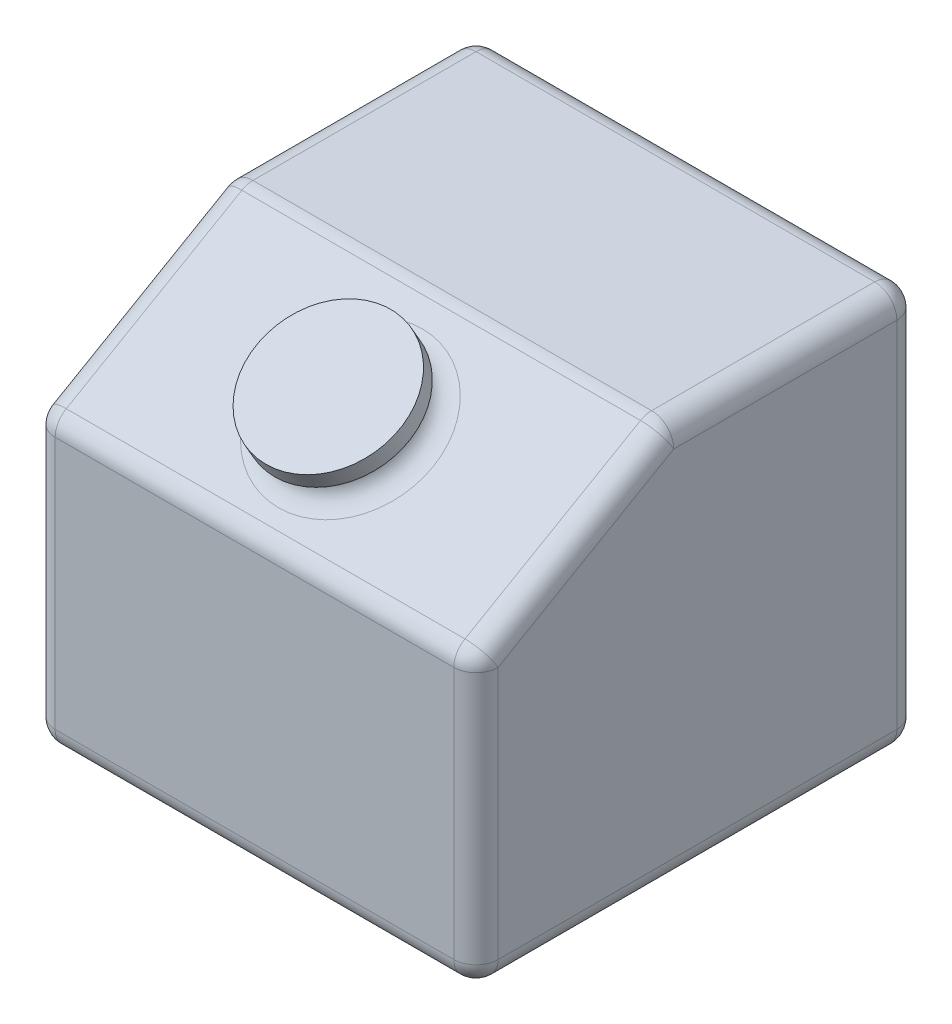
ISO-10303-21;
HEADER;
FILE_DESCRIPTION(('STEP AP214'),'2;1');
FILE_NAME('part.step','',(''),(''),'','','');
FILE_SCHEMA(('AUTOMOTIVE_DESIGN { 1 0 10303 214 1 1 1 1 }'));
ENDSEC;
DATA;
#1=APPLICATION_CONTEXT('core data for automotive mechanical design processes');
#2=APPLICATION_PROTOCOL_DEFINITION('international standard','automotive_design',2000,#1);
#3=PRODUCT_CONTEXT('',#1,'mechanical');
#4=PRODUCT('Part','Part','',(#3));
#5=PRODUCT_RELATED_PRODUCT_CATEGORY('part','',(#4));
#6=PRODUCT_DEFINITION_FORMATION('','',#4);
#7=PRODUCT_DEFINITION_CONTEXT('part definition',#1,'design');
#8=PRODUCT_DEFINITION('design','',#6,#7);
#9=PRODUCT_DEFINITION_SHAPE('','',#8);
#10=(LENGTH_UNIT() NAMED_UNIT(*) SI_UNIT(.MILLI.,.METRE.));
#11=(NAMED_UNIT(*) PLANE_ANGLE_UNIT() SI_UNIT($,.RADIAN.));
#12=(NAMED_UNIT(*) SI_UNIT($,.STERADIAN.) SOLID_ANGLE_UNIT());
#13=UNCERTAINTY_MEASURE_WITH_UNIT(LENGTH_MEASURE(1.E-05),#10,'distance_accuracy_value','');
#14=(GEOMETRIC_REPRESENTATION_CONTEXT(3) GLOBAL_UNCERTAINTY_ASSIGNED_CONTEXT((#13)) GLOBAL_UNIT_ASSIGNED_CONTEXT((#10,
#11,#12)) REPRESENTATION_CONTEXT('',''));
#15=CARTESIAN_POINT('',(0.,0.,0.));
#16=DIRECTION('',(0.,0.,1.));
#17=DIRECTION('',(1.,0.,0.));
#18=AXIS2_PLACEMENT_3D('',#15,#16,#17);
#19=CARTESIAN_POINT('',(100.,172.320508075689,-33.3012701892218));
#20=DIRECTION('',(0.,-0.866025403784438,-0.500000000000001));
#21=DIRECTION('',(0.,0.500000000000001,-0.866025403784438));
#22=AXIS2_PLACEMENT_3D('',#19,#20,#21);
#23=CYLINDRICAL_SURFACE('',#22,27.5);
#24=CARTESIAN_POINT('',(100.,163.660254037844,-38.3012701892219));
#25=DIRECTION('',(0.,-0.866025403784438,-0.500000000000001));
#26=DIRECTION('',(0.,0.500000000000001,-0.866025403784438));
#27=AXIS2_PLACEMENT_3D('',#24,#25,#26);
#28=CIRCLE('',#27,27.5);
#29=CARTESIAN_POINT('',(100.,177.410254037844,-62.1169687932939));
#30=VERTEX_POINT('',#29);
#31=EDGE_CURVE('E231',#30,#30,#28,.F.);
#32=ORIENTED_EDGE('',*,*,#31,.T.);
#33=EDGE_LOOP('',(#32));
#34=FACE_BOUND('',#33,.T.);
#35=CARTESIAN_POINT('',(100.,165.392304845413,-37.3012701892219));
#36=DIRECTION('',(0.,0.866025403784438,0.500000000000001));
#37=DIRECTION('',(0.,-0.500000000000001,0.866025403784438));
#38=AXIS2_PLACEMENT_3D('',#35,#36,#37);
#39=CIRCLE('',#38,27.5);
#40=CARTESIAN_POINT('',(100.,151.642304845413,-13.4855715851498));
#41=VERTEX_POINT('',#40);
#42=EDGE_CURVE('E225',#41,#41,#39,.T.);
#43=ORIENTED_EDGE('',*,*,#42,.F.);
#44=EDGE_LOOP('',(#43));
#45=FACE_BOUND('',#44,.T.);
#46=ADVANCED_FACE('F35',(#34,#45),#23,.T.);
#47=CARTESIAN_POINT('',(0.,180.,0.));
#48=DIRECTION('',(1.,0.,0.));
#49=DIRECTION('',(0.,0.,-1.));
#50=AXIS2_PLACEMENT_3D('',#47,#48,#49);
#51=PLANE('',#50);
#52=DIRECTION('',(0.,-0.500000000000001,0.866025403784438));
#53=VECTOR('',#52,1.);
#54=CARTESIAN_POINT('',(0.,171.339745962156,-91.6025403784437));
#55=LINE('',#54,#53);
#56=CARTESIAN_POINT('',(0.,124.226497308104,-10.));
#57=VERTEX_POINT('',#56);
#58=CARTESIAN_POINT('',(0.,170.,-89.2820323027549));
#59=VERTEX_POINT('',#58);
#60=EDGE_CURVE('E261',#57,#59,#55,.F.);
#61=ORIENTED_EDGE('',*,*,#60,.T.);
#62=DIRECTION('',(0.,0.,1.));
#63=VECTOR('',#62,1.);
#64=CARTESIAN_POINT('',(0.,170.,0.));
#65=LINE('',#64,#63);
#66=CARTESIAN_POINT('',(0.,170.,-190.));
#67=VERTEX_POINT('',#66);
#68=EDGE_CURVE('E263',#59,#67,#65,.F.);
#69=ORIENTED_EDGE('',*,*,#68,.T.);
#70=DIRECTION('',(0.,-1.,0.));
#71=VECTOR('',#70,1.);
#72=CARTESIAN_POINT('',(0.,180.,-190.));
#73=LINE('',#72,#71);
#74=CARTESIAN_POINT('',(0.,10.,-190.));
#75=VERTEX_POINT('',#74);
#76=EDGE_CURVE('E259',#67,#75,#73,.T.);
#77=ORIENTED_EDGE('',*,*,#76,.T.);
#78=DIRECTION('',(0.,0.,1.));
#79=VECTOR('',#78,1.);
#80=CARTESIAN_POINT('',(0.,10.,0.));
#81=LINE('',#80,#79);
#82=CARTESIAN_POINT('',(0.,10.,-10.));
#83=VERTEX_POINT('',#82);
#84=EDGE_CURVE('E255',#75,#83,#81,.T.);
#85=ORIENTED_EDGE('',*,*,#84,.T.);
#86=DIRECTION('',(0.,-1.,0.));
#87=VECTOR('',#86,1.);
#88=CARTESIAN_POINT('',(0.,180.,-10.));
#89=LINE('',#88,#87);
#90=EDGE_CURVE('E257',#83,#57,#89,.F.);
#91=ORIENTED_EDGE('',*,*,#90,.T.);
#92=EDGE_LOOP('',(#61,#69,#77,#85,#91));
#93=FACE_BOUND('',#92,.T.);
#94=ADVANCED_FACE('F413',(#93),#51,.F.);
#95=CARTESIAN_POINT('',(0.,180.,0.));
#96=DIRECTION('',(0.,0.,-1.));
#97=DIRECTION('',(-1.,0.,0.));
#98=AXIS2_PLACEMENT_3D('',#95,#96,#97);
#99=PLANE('',#98);
#100=DIRECTION('',(1.,0.,0.));
#101=VECTOR('',#100,1.);
#102=CARTESIAN_POINT('',(0.,124.226497308104,0.));
#103=LINE('',#102,#101);
#104=CARTESIAN_POINT('',(190.,124.226497308104,0.));
#105=VERTEX_POINT('',#104);
#106=CARTESIAN_POINT('',(10.,124.226497308104,0.));
#107=VERTEX_POINT('',#106);
#108=EDGE_CURVE('E290',#105,#107,#103,.F.);
#109=ORIENTED_EDGE('',*,*,#108,.T.);
#110=DIRECTION('',(0.,-1.,0.));
#111=VECTOR('',#110,1.);
#112=CARTESIAN_POINT('',(10.,180.,0.));
#113=LINE('',#112,#111);
#114=CARTESIAN_POINT('',(10.,10.,0.));
#115=VERTEX_POINT('',#114);
#116=EDGE_CURVE('E292',#107,#115,#113,.T.);
#117=ORIENTED_EDGE('',*,*,#116,.T.);
#118=DIRECTION('',(1.,0.,0.));
#119=VECTOR('',#118,1.);
#120=CARTESIAN_POINT('',(200.,10.,0.));
#121=LINE('',#120,#119);
#122=CARTESIAN_POINT('',(190.,10.,0.));
#123=VERTEX_POINT('',#122);
#124=EDGE_CURVE('E286',#115,#123,#121,.T.);
#125=ORIENTED_EDGE('',*,*,#124,.T.);
#126=DIRECTION('',(0.,-1.,0.));
#127=VECTOR('',#126,1.);
#128=CARTESIAN_POINT('',(190.,180.,0.));
#129=LINE('',#128,#127);
#130=EDGE_CURVE('E288',#123,#105,#129,.F.);
#131=ORIENTED_EDGE('',*,*,#130,.T.);
#132=EDGE_LOOP('',(#109,#117,#125,#131));
#133=FACE_BOUND('',#132,.T.);
#134=ADVANCED_FACE('F392',(#133),#99,.F.);
#135=CARTESIAN_POINT('',(200.,180.,0.));
#136=DIRECTION('',(-1.,0.,0.));
#137=DIRECTION('',(0.,0.,1.));
#138=AXIS2_PLACEMENT_3D('',#135,#136,#137);
#139=PLANE('',#138);
#140=DIRECTION('',(0.,-1.,0.));
#141=VECTOR('',#140,1.);
#142=CARTESIAN_POINT('',(200.,180.,-190.));
#143=LINE('',#142,#141);
#144=CARTESIAN_POINT('',(200.,10.,-190.));
#145=VERTEX_POINT('',#144);
#146=CARTESIAN_POINT('',(200.,170.,-190.));
#147=VERTEX_POINT('',#146);
#148=EDGE_CURVE('E281',#145,#147,#143,.F.);
#149=ORIENTED_EDGE('',*,*,#148,.T.);
#150=DIRECTION('',(0.,0.,-1.));
#151=VECTOR('',#150,1.);
#152=CARTESIAN_POINT('',(200.,170.,0.));
#153=LINE('',#152,#151);
#154=CARTESIAN_POINT('',(200.,170.,-89.282032302755));
#155=VERTEX_POINT('',#154);
#156=EDGE_CURVE('E284',#147,#155,#153,.F.);
#157=ORIENTED_EDGE('',*,*,#156,.T.);
#158=DIRECTION('',(0.,0.500000000000001,-0.866025403784438));
#159=VECTOR('',#158,1.);
#160=CARTESIAN_POINT('',(200.,121.339745962156,-5.));
#161=LINE('',#160,#159);
#162=CARTESIAN_POINT('',(200.,124.226497308104,-10.));
#163=VERTEX_POINT('',#162);
#164=EDGE_CURVE('E279',#155,#163,#161,.F.);
#165=ORIENTED_EDGE('',*,*,#164,.T.);
#166=DIRECTION('',(0.,-1.,0.));
#167=VECTOR('',#166,1.);
#168=CARTESIAN_POINT('',(200.,180.,-10.));
#169=LINE('',#168,#167);
#170=CARTESIAN_POINT('',(200.,10.,-10.));
#171=VERTEX_POINT('',#170);
#172=EDGE_CURVE('E277',#163,#171,#169,.T.);
#173=ORIENTED_EDGE('',*,*,#172,.T.);
#174=DIRECTION('',(0.,0.,-1.));
#175=VECTOR('',#174,1.);
#176=CARTESIAN_POINT('',(200.,10.,-200.));
#177=LINE('',#176,#175);
#178=EDGE_CURVE('E275',#171,#145,#177,.T.);
#179=ORIENTED_EDGE('',*,*,#178,.T.);
#180=EDGE_LOOP('',(#149,#157,#165,#173,#179));
#181=FACE_BOUND('',#180,.T.);
#182=ADVANCED_FACE('F490',(#181),#139,.F.);
#183=CARTESIAN_POINT('',(0.,180.,-200.));
#184=DIRECTION('',(0.,0.,1.));
#185=DIRECTION('',(1.,0.,0.));
#186=AXIS2_PLACEMENT_3D('',#183,#184,#185);
#187=PLANE('',#186);
#188=DIRECTION('',(0.,-1.,0.));
#189=VECTOR('',#188,1.);
#190=CARTESIAN_POINT('',(10.,180.,-200.));
#191=LINE('',#190,#189);
#192=CARTESIAN_POINT('',(10.,10.,-200.));
#193=VERTEX_POINT('',#192);
#194=CARTESIAN_POINT('',(10.,170.,-200.));
#195=VERTEX_POINT('',#194);
#196=EDGE_CURVE('E270',#193,#195,#191,.F.);
#197=ORIENTED_EDGE('',*,*,#196,.T.);
#198=DIRECTION('',(-1.,0.,0.));
#199=VECTOR('',#198,1.);
#200=CARTESIAN_POINT('',(0.,170.,-200.));
#201=LINE('',#200,#199);
#202=CARTESIAN_POINT('',(190.,170.,-200.));
#203=VERTEX_POINT('',#202);
#204=EDGE_CURVE('E272',#195,#203,#201,.F.);
#205=ORIENTED_EDGE('',*,*,#204,.T.);
#206=DIRECTION('',(0.,-1.,0.));
#207=VECTOR('',#206,1.);
#208=CARTESIAN_POINT('',(190.,180.,-200.));
#209=LINE('',#208,#207);
#210=CARTESIAN_POINT('',(190.,10.,-200.));
#211=VERTEX_POINT('',#210);
#212=EDGE_CURVE('E268',#203,#211,#209,.T.);
#213=ORIENTED_EDGE('',*,*,#212,.T.);
#214=DIRECTION('',(-1.,0.,0.));
#215=VECTOR('',#214,1.);
#216=CARTESIAN_POINT('',(0.,10.,-200.));
#217=LINE('',#216,#215);
#218=EDGE_CURVE('E266',#211,#193,#217,.T.);
#219=ORIENTED_EDGE('',*,*,#218,.T.);
#220=EDGE_LOOP('',(#197,#205,#213,#219));
#221=FACE_BOUND('',#220,.T.);
#222=ADVANCED_FACE('F485',(#221),#187,.F.);
#223=CARTESIAN_POINT('',(0.,180.,0.));
#224=DIRECTION('',(0.,-1.,0.));
#225=DIRECTION('',(0.,0.,-1.));
#226=AXIS2_PLACEMENT_3D('',#223,#224,#225);
#227=PLANE('',#226);
#228=DIRECTION('',(0.,0.,1.));
#229=VECTOR('',#228,1.);
#230=CARTESIAN_POINT('',(10.,180.,0.));
#231=LINE('',#230,#229);
#232=CARTESIAN_POINT('',(10.,180.,-190.));
#233=VERTEX_POINT('',#232);
#234=CARTESIAN_POINT('',(10.,180.,-89.282032302755));
#235=VERTEX_POINT('',#234);
#236=EDGE_CURVE('E250',#233,#235,#231,.T.);
#237=ORIENTED_EDGE('',*,*,#236,.T.);
#238=DIRECTION('',(-1.,0.,0.));
#239=VECTOR('',#238,1.);
#240=CARTESIAN_POINT('',(200.,180.,-89.282032302755));
#241=LINE('',#240,#239);
#242=CARTESIAN_POINT('',(190.,180.,-89.282032302755));
#243=VERTEX_POINT('',#242);
#244=EDGE_CURVE('E252',#235,#243,#241,.F.);
#245=ORIENTED_EDGE('',*,*,#244,.T.);
#246=DIRECTION('',(0.,0.,-1.));
#247=VECTOR('',#246,1.);
#248=CARTESIAN_POINT('',(190.,180.,0.));
#249=LINE('',#248,#247);
#250=CARTESIAN_POINT('',(190.,180.,-190.));
#251=VERTEX_POINT('',#250);
#252=EDGE_CURVE('E246',#243,#251,#249,.T.);
#253=ORIENTED_EDGE('',*,*,#252,.T.);
#254=DIRECTION('',(-1.,0.,0.));
#255=VECTOR('',#254,1.);
#256=CARTESIAN_POINT('',(0.,180.,-190.));
#257=LINE('',#256,#255);
#258=EDGE_CURVE('E248',#251,#233,#257,.T.);
#259=ORIENTED_EDGE('',*,*,#258,.T.);
#260=EDGE_LOOP('',(#237,#245,#253,#259));
#261=FACE_BOUND('',#260,.T.);
#262=ADVANCED_FACE('F478',(#261),#227,.F.);
#263=CARTESIAN_POINT('',(0.,0.,0.));
#264=DIRECTION('',(0.,-1.,0.));
#265=DIRECTION('',(0.,0.,-1.));
#266=AXIS2_PLACEMENT_3D('',#263,#264,#265);
#267=PLANE('',#266);
#268=DIRECTION('',(0.,0.,-1.));
#269=VECTOR('',#268,1.);
#270=CARTESIAN_POINT('',(190.,0.,0.));
#271=LINE('',#270,#269);
#272=CARTESIAN_POINT('',(190.,0.,-190.));
#273=VERTEX_POINT('',#272);
#274=CARTESIAN_POINT('',(190.,0.,-10.));
#275=VERTEX_POINT('',#274);
#276=EDGE_CURVE('E44',#273,#275,#271,.F.);
#277=ORIENTED_EDGE('',*,*,#276,.T.);
#278=DIRECTION('',(1.,0.,0.));
#279=VECTOR('',#278,1.);
#280=CARTESIAN_POINT('',(0.,0.,-10.));
#281=LINE('',#280,#279);
#282=CARTESIAN_POINT('',(10.,0.,-10.));
#283=VERTEX_POINT('',#282);
#284=EDGE_CURVE('E11',#275,#283,#281,.F.);
#285=ORIENTED_EDGE('',*,*,#284,.T.);
#286=DIRECTION('',(0.,0.,1.));
#287=VECTOR('',#286,1.);
#288=CARTESIAN_POINT('',(10.,0.,-200.));
#289=LINE('',#288,#287);
#290=CARTESIAN_POINT('',(10.,0.,-190.));
#291=VERTEX_POINT('',#290);
#292=EDGE_CURVE('E295',#283,#291,#289,.F.);
#293=ORIENTED_EDGE('',*,*,#292,.T.);
#294=DIRECTION('',(-1.,0.,0.));
#295=VECTOR('',#294,1.);
#296=CARTESIAN_POINT('',(200.,0.,-190.));
#297=LINE('',#296,#295);
#298=EDGE_CURVE('E55',#291,#273,#297,.F.);
#299=ORIENTED_EDGE('',*,*,#298,.T.);
#300=EDGE_LOOP('',(#277,#285,#293,#299));
#301=FACE_BOUND('',#300,.T.);
#302=ADVANCED_FACE('F515',(#301),#267,.T.);
#303=CARTESIAN_POINT('',(0.,180.,-86.6025403784437));
#304=DIRECTION('',(0.,-0.866025403784438,-0.500000000000001));
#305=DIRECTION('',(1.,0.,0.));
#306=AXIS2_PLACEMENT_3D('',#303,#304,#305);
#307=PLANE('',#306);
#308=CARTESIAN_POINT('',(100.,155.,-43.3012701892219));
#309=DIRECTION('',(0.,-0.866025403784438,-0.500000000000001));
#310=DIRECTION('',(0.,0.500000000000001,-0.866025403784438));
#311=AXIS2_PLACEMENT_3D('',#308,#309,#310);
#312=CIRCLE('',#311,37.5);
#313=CARTESIAN_POINT('',(100.,173.75,-75.7772228311383));
#314=VERTEX_POINT('',#313);
#315=EDGE_CURVE('E243',#314,#314,#312,.T.);
#316=ORIENTED_EDGE('',*,*,#315,.T.);
#317=EDGE_LOOP('',(#316));
#318=FACE_BOUND('',#317,.T.);
#319=DIRECTION('',(0.,-0.500000000000001,0.866025403784438));
#320=VECTOR('',#319,1.);
#321=CARTESIAN_POINT('',(190.,180.,-86.6025403784437));
#322=LINE('',#321,#320);
#323=CARTESIAN_POINT('',(190.,132.886751345948,-4.99999999999998));
#324=VERTEX_POINT('',#323);
#325=CARTESIAN_POINT('',(190.,178.660254037844,-84.2820323027549));
#326=VERTEX_POINT('',#325);
#327=EDGE_CURVE('E236',#324,#326,#322,.F.);
#328=ORIENTED_EDGE('',*,*,#327,.T.);
#329=DIRECTION('',(1.,0.,0.));
#330=VECTOR('',#329,1.);
#331=CARTESIAN_POINT('',(0.,178.660254037844,-84.2820323027549));
#332=LINE('',#331,#330);
#333=CARTESIAN_POINT('',(10.,178.660254037844,-84.2820323027549));
#334=VERTEX_POINT('',#333);
#335=EDGE_CURVE('E240',#326,#334,#332,.F.);
#336=ORIENTED_EDGE('',*,*,#335,.T.);
#337=DIRECTION('',(0.,0.500000000000001,-0.866025403784438));
#338=VECTOR('',#337,1.);
#339=CARTESIAN_POINT('',(10.,130.,0.));
#340=LINE('',#339,#338);
#341=CARTESIAN_POINT('',(10.,132.886751345948,-4.99999999999998));
#342=VERTEX_POINT('',#341);
#343=EDGE_CURVE('E238',#334,#342,#340,.F.);
#344=ORIENTED_EDGE('',*,*,#343,.T.);
#345=DIRECTION('',(-1.,0.,0.));
#346=VECTOR('',#345,1.);
#347=CARTESIAN_POINT('',(200.,132.886751345948,-4.99999999999998));
#348=LINE('',#347,#346);
#349=EDGE_CURVE('E234',#342,#324,#348,.F.);
#350=ORIENTED_EDGE('',*,*,#349,.T.);
#351=EDGE_LOOP('',(#328,#336,#344,#350));
#352=FACE_BOUND('',#351,.T.);
#353=ADVANCED_FACE('F464',(#318,#352),#307,.F.);
#354=CARTESIAN_POINT('',(100.,165.392304845413,-37.3012701892218));
#355=DIRECTION('',(0.,0.866025403784438,0.500000000000001));
#356=DIRECTION('',(0.,-0.500000000000001,0.866025403784438));
#357=AXIS2_PLACEMENT_3D('',#354,#355,#356);
#358=CYLINDRICAL_SURFACE('',#357,32.5);
#359=CARTESIAN_POINT('',(100.,165.392304845413,-37.3012701892218));
#360=DIRECTION('',(0.,0.866025403784438,0.500000000000001));
#361=DIRECTION('',(0.,-0.500000000000001,0.866025403784438));
#362=AXIS2_PLACEMENT_3D('',#359,#360,#361);
#363=CIRCLE('',#362,32.5);
#364=CARTESIAN_POINT('',(100.,149.142304845413,-9.15544456622762));
#365=VERTEX_POINT('',#364);
#366=EDGE_CURVE('E222',#365,#365,#363,.T.);
#367=ORIENTED_EDGE('',*,*,#366,.T.);
#368=EDGE_LOOP('',(#367));
#369=FACE_BOUND('',#368,.T.);
#370=CARTESIAN_POINT('',(100.,172.320508075689,-33.3012701892218));
#371=DIRECTION('',(0.,0.866025403784438,0.500000000000001));
#372=DIRECTION('',(0.,-0.500000000000001,0.866025403784438));
#373=AXIS2_PLACEMENT_3D('',#370,#371,#372);
#374=CIRCLE('',#373,32.5);
#375=CARTESIAN_POINT('',(100.,156.070508075689,-5.15544456622761));
#376=VERTEX_POINT('',#375);
#377=EDGE_CURVE('E226',#376,#376,#374,.T.);
#378=ORIENTED_EDGE('',*,*,#377,.F.);
#379=EDGE_LOOP('',(#378));
#380=FACE_BOUND('',#379,.T.);
#381=ADVANCED_FACE('F526',(#369,#380),#358,.T.);
#382=CARTESIAN_POINT('',(100.,165.392304845413,-37.3012701892218));
#383=DIRECTION('',(0.,0.866025403784438,0.500000000000001));
#384=DIRECTION('',(0.,-0.500000000000001,0.866025403784438));
#385=AXIS2_PLACEMENT_3D('',#382,#383,#384);
#386=PLANE('',#385);
#387=ORIENTED_EDGE('',*,*,#42,.T.);
#388=EDGE_LOOP('',(#387));
#389=FACE_BOUND('',#388,.T.);
#390=ORIENTED_EDGE('',*,*,#366,.F.);
#391=EDGE_LOOP('',(#390));
#392=FACE_BOUND('',#391,.T.);
#393=ADVANCED_FACE('F785',(#389,#392),#386,.F.);
#394=CARTESIAN_POINT('',(0.,114.820508075689,66.2916512459886));
#395=DIRECTION('',(0.,0.866025403784438,0.500000000000001));
#396=DIRECTION('',(0.,-0.500000000000002,0.866025403784438));
#397=AXIS2_PLACEMENT_3D('',#394,#395,#396);
#398=PLANE('',#397);
#399=ORIENTED_EDGE('',*,*,#377,.T.);
#400=EDGE_LOOP('',(#399));
#401=FACE_BOUND('',#400,.T.);
#402=ADVANCED_FACE('F511',(#401),#398,.T.);
#403=CARTESIAN_POINT('',(100.,163.660254037844,-38.3012701892219));
#404=DIRECTION('',(0.,-0.866025403784438,-0.500000000000001));
#405=DIRECTION('',(0.,0.500000000000001,-0.866025403784438));
#406=AXIS2_PLACEMENT_3D('',#403,#404,#405);
#407=TOROIDAL_SURFACE('',#406,37.5,10.);
#408=ORIENTED_EDGE('',*,*,#315,.F.);
#409=EDGE_LOOP('',(#408));
#410=FACE_BOUND('',#409,.T.);
#411=ORIENTED_EDGE('',*,*,#31,.F.);
#412=EDGE_LOOP('',(#411));
#413=FACE_BOUND('',#412,.T.);
#414=ADVANCED_FACE('F528',(#410,#413),#407,.F.);
#415=CARTESIAN_POINT('',(10.,10.,0.));
#416=DIRECTION('',(0.,0.,-1.));
#417=DIRECTION('',(-1.,0.,0.));
#418=AXIS2_PLACEMENT_3D('',#415,#416,#417);
#419=CYLINDRICAL_SURFACE('',#418,10.);
#420=CARTESIAN_POINT('',(10.,10.,-190.));
#421=DIRECTION('',(0.,0.,-1.));
#422=DIRECTION('',(-1.,0.,0.));
#423=AXIS2_PLACEMENT_3D('',#420,#421,#422);
#424=CIRCLE('',#423,10.);
#425=EDGE_CURVE('E374',#291,#75,#424,.T.);
#426=ORIENTED_EDGE('',*,*,#425,.F.);
#427=ORIENTED_EDGE('',*,*,#292,.F.);
#428=CARTESIAN_POINT('',(10.,10.,-10.));
#429=DIRECTION('',(0.,0.,1.));
#430=DIRECTION('',(1.,0.,0.));
#431=AXIS2_PLACEMENT_3D('',#428,#429,#430);
#432=CIRCLE('',#431,10.);
#433=EDGE_CURVE('E376',#83,#283,#432,.T.);
#434=ORIENTED_EDGE('',*,*,#433,.F.);
#435=ORIENTED_EDGE('',*,*,#84,.F.);
#436=EDGE_LOOP('',(#426,#427,#434,#435));
#437=FACE_BOUND('',#436,.T.);
#438=ADVANCED_FACE('F37',(#437),#419,.T.);
#439=CARTESIAN_POINT('',(0.,10.,-190.));
#440=DIRECTION('',(1.,0.,0.));
#441=DIRECTION('',(0.,0.,-1.));
#442=AXIS2_PLACEMENT_3D('',#439,#440,#441);
#443=CYLINDRICAL_SURFACE('',#442,10.);
#444=CARTESIAN_POINT('',(190.,10.,-190.));
#445=DIRECTION('',(1.,0.,0.));
#446=DIRECTION('',(0.,0.,-1.));
#447=AXIS2_PLACEMENT_3D('',#444,#445,#446);
#448=CIRCLE('',#447,10.);
#449=EDGE_CURVE('E368',#273,#211,#448,.T.);
#450=ORIENTED_EDGE('',*,*,#449,.F.);
#451=ORIENTED_EDGE('',*,*,#298,.F.);
#452=CARTESIAN_POINT('',(10.,10.,-190.));
#453=DIRECTION('',(-1.,0.,0.));
#454=DIRECTION('',(0.,0.,1.));
#455=AXIS2_PLACEMENT_3D('',#452,#453,#454);
#456=CIRCLE('',#455,10.);
#457=EDGE_CURVE('E371',#193,#291,#456,.T.);
#458=ORIENTED_EDGE('',*,*,#457,.F.);
#459=ORIENTED_EDGE('',*,*,#218,.F.);
#460=EDGE_LOOP('',(#450,#451,#458,#459));
#461=FACE_BOUND('',#460,.T.);
#462=ADVANCED_FACE('F438',(#461),#443,.T.);
#463=CARTESIAN_POINT('',(190.,10.,0.));
#464=DIRECTION('',(0.,0.,1.));
#465=DIRECTION('',(1.,0.,0.));
#466=AXIS2_PLACEMENT_3D('',#463,#464,#465);
#467=CYLINDRICAL_SURFACE('',#466,10.);
#468=CARTESIAN_POINT('',(190.,10.,-10.));
#469=DIRECTION('',(0.,0.,1.));
#470=DIRECTION('',(1.,0.,0.));
#471=AXIS2_PLACEMENT_3D('',#468,#469,#470);
#472=CIRCLE('',#471,10.);
#473=EDGE_CURVE('E362',#275,#171,#472,.T.);
#474=ORIENTED_EDGE('',*,*,#473,.F.);
#475=ORIENTED_EDGE('',*,*,#276,.F.);
#476=CARTESIAN_POINT('',(190.,10.,-190.));
#477=DIRECTION('',(0.,0.,-1.));
#478=DIRECTION('',(-1.,0.,0.));
#479=AXIS2_PLACEMENT_3D('',#476,#477,#478);
#480=CIRCLE('',#479,10.);
#481=EDGE_CURVE('E365',#145,#273,#480,.T.);
#482=ORIENTED_EDGE('',*,*,#481,.F.);
#483=ORIENTED_EDGE('',*,*,#178,.F.);
#484=EDGE_LOOP('',(#474,#475,#482,#483));
#485=FACE_BOUND('',#484,.T.);
#486=ADVANCED_FACE('F447',(#485),#467,.T.);
#487=CARTESIAN_POINT('',(0.,10.,-10.));
#488=DIRECTION('',(-1.,0.,0.));
#489=DIRECTION('',(0.,0.,1.));
#490=AXIS2_PLACEMENT_3D('',#487,#488,#489);
#491=CYLINDRICAL_SURFACE('',#490,10.);
#492=CARTESIAN_POINT('',(10.,10.,-10.));
#493=DIRECTION('',(-1.,0.,0.));
#494=DIRECTION('',(0.,0.,1.));
#495=AXIS2_PLACEMENT_3D('',#492,#493,#494);
#496=CIRCLE('',#495,10.);
#497=EDGE_CURVE('E39',#283,#115,#496,.T.);
#498=ORIENTED_EDGE('',*,*,#497,.F.);
#499=ORIENTED_EDGE('',*,*,#284,.F.);
#500=CARTESIAN_POINT('',(190.,10.,-10.));
#501=DIRECTION('',(1.,0.,0.));
#502=DIRECTION('',(0.,0.,-1.));
#503=AXIS2_PLACEMENT_3D('',#500,#501,#502);
#504=CIRCLE('',#503,10.);
#505=EDGE_CURVE('E359',#123,#275,#504,.T.);
#506=ORIENTED_EDGE('',*,*,#505,.F.);
#507=ORIENTED_EDGE('',*,*,#124,.F.);
#508=EDGE_LOOP('',(#498,#499,#506,#507));
#509=FACE_BOUND('',#508,.T.);
#510=ADVANCED_FACE('F388',(#509),#491,.T.);
#511=CARTESIAN_POINT('',(10.,10.,-10.));
#512=DIRECTION('',(0.,0.,1.));
#513=DIRECTION('',(1.,0.,0.));
#514=AXIS2_PLACEMENT_3D('',#511,#512,#513);
#515=SPHERICAL_SURFACE('',#514,10.);
#516=ORIENTED_EDGE('',*,*,#433,.T.);
#517=ORIENTED_EDGE('',*,*,#497,.T.);
#518=CARTESIAN_POINT('',(10.,10.,-10.));
#519=DIRECTION('',(0.,-1.,0.));
#520=DIRECTION('',(0.,0.,-1.));
#521=AXIS2_PLACEMENT_3D('',#518,#519,#520);
#522=CIRCLE('',#521,10.);
#523=EDGE_CURVE('E357',#83,#115,#522,.F.);
#524=ORIENTED_EDGE('',*,*,#523,.F.);
#525=EDGE_LOOP('',(#516,#517,#524));
#526=FACE_BOUND('',#525,.T.);
#527=ADVANCED_FACE('F383',(#526),#515,.T.);
#528=CARTESIAN_POINT('',(10.,10.,-190.));
#529=DIRECTION('',(0.,0.,1.));
#530=DIRECTION('',(1.,0.,0.));
#531=AXIS2_PLACEMENT_3D('',#528,#529,#530);
#532=SPHERICAL_SURFACE('',#531,10.);
#533=ORIENTED_EDGE('',*,*,#457,.T.);
#534=ORIENTED_EDGE('',*,*,#425,.T.);
#535=CARTESIAN_POINT('',(10.,10.,-190.));
#536=DIRECTION('',(0.,-1.,0.));
#537=DIRECTION('',(0.,0.,-1.));
#538=AXIS2_PLACEMENT_3D('',#535,#536,#537);
#539=CIRCLE('',#538,10.);
#540=EDGE_CURVE('E354',#193,#75,#539,.F.);
#541=ORIENTED_EDGE('',*,*,#540,.F.);
#542=EDGE_LOOP('',(#533,#534,#541));
#543=FACE_BOUND('',#542,.T.);
#544=ADVANCED_FACE('F433',(#543),#532,.T.);
#545=CARTESIAN_POINT('',(190.,10.,-190.));
#546=DIRECTION('',(0.,0.,1.));
#547=DIRECTION('',(1.,0.,0.));
#548=AXIS2_PLACEMENT_3D('',#545,#546,#547);
#549=SPHERICAL_SURFACE('',#548,10.);
#550=ORIENTED_EDGE('',*,*,#481,.T.);
#551=ORIENTED_EDGE('',*,*,#449,.T.);
#552=CARTESIAN_POINT('',(190.,10.,-190.));
#553=DIRECTION('',(0.,-1.,0.));
#554=DIRECTION('',(0.,0.,-1.));
#555=AXIS2_PLACEMENT_3D('',#552,#553,#554);
#556=CIRCLE('',#555,10.);
#557=EDGE_CURVE('E351',#145,#211,#556,.F.);
#558=ORIENTED_EDGE('',*,*,#557,.F.);
#559=EDGE_LOOP('',(#550,#551,#558));
#560=FACE_BOUND('',#559,.T.);
#561=ADVANCED_FACE('F442',(#560),#549,.T.);
#562=CARTESIAN_POINT('',(190.,10.,-10.));
#563=DIRECTION('',(0.,0.,1.));
#564=DIRECTION('',(1.,0.,0.));
#565=AXIS2_PLACEMENT_3D('',#562,#563,#564);
#566=SPHERICAL_SURFACE('',#565,10.);
#567=ORIENTED_EDGE('',*,*,#505,.T.);
#568=ORIENTED_EDGE('',*,*,#473,.T.);
#569=CARTESIAN_POINT('',(190.,10.,-10.));
#570=DIRECTION('',(0.,-1.,0.));
#571=DIRECTION('',(0.,0.,-1.));
#572=AXIS2_PLACEMENT_3D('',#569,#570,#571);
#573=CIRCLE('',#572,10.);
#574=EDGE_CURVE('E348',#123,#171,#573,.F.);
#575=ORIENTED_EDGE('',*,*,#574,.F.);
#576=EDGE_LOOP('',(#567,#568,#575));
#577=FACE_BOUND('',#576,.T.);
#578=ADVANCED_FACE('F449',(#577),#566,.T.);
#579=CARTESIAN_POINT('',(10.,180.,-10.));
#580=DIRECTION('',(0.,-1.,0.));
#581=DIRECTION('',(0.,0.,-1.));
#582=AXIS2_PLACEMENT_3D('',#579,#580,#581);
#583=CYLINDRICAL_SURFACE('',#582,10.);
#584=ORIENTED_EDGE('',*,*,#523,.T.);
#585=ORIENTED_EDGE('',*,*,#116,.F.);
#586=CARTESIAN_POINT('',(10.,124.226497308104,-10.));
#587=DIRECTION('',(0.,1.,0.));
#588=DIRECTION('',(0.,0.,1.));
#589=AXIS2_PLACEMENT_3D('',#586,#587,#588);
#590=CIRCLE('',#589,10.);
#591=EDGE_CURVE('E342',#57,#107,#590,.T.);
#592=ORIENTED_EDGE('',*,*,#591,.F.);
#593=ORIENTED_EDGE('',*,*,#90,.F.);
#594=EDGE_LOOP('',(#584,#585,#592,#593));
#595=FACE_BOUND('',#594,.T.);
#596=ADVANCED_FACE('F397',(#595),#583,.T.);
#597=CARTESIAN_POINT('',(10.,180.,-190.));
#598=DIRECTION('',(0.,-1.,0.));
#599=DIRECTION('',(0.,0.,-1.));
#600=AXIS2_PLACEMENT_3D('',#597,#598,#599);
#601=CYLINDRICAL_SURFACE('',#600,10.);
#602=ORIENTED_EDGE('',*,*,#540,.T.);
#603=ORIENTED_EDGE('',*,*,#76,.F.);
#604=CARTESIAN_POINT('',(10.,170.,-190.));
#605=DIRECTION('',(0.,1.,0.));
#606=DIRECTION('',(0.,0.,1.));
#607=AXIS2_PLACEMENT_3D('',#604,#605,#606);
#608=CIRCLE('',#607,10.);
#609=EDGE_CURVE('E339',#195,#67,#608,.T.);
#610=ORIENTED_EDGE('',*,*,#609,.F.);
#611=ORIENTED_EDGE('',*,*,#196,.F.);
#612=EDGE_LOOP('',(#602,#603,#610,#611));
#613=FACE_BOUND('',#612,.T.);
#614=ADVANCED_FACE('F427',(#613),#601,.T.);
#615=CARTESIAN_POINT('',(0.,170.,-190.));
#616=DIRECTION('',(-1.,0.,0.));
#617=DIRECTION('',(0.,0.,1.));
#618=AXIS2_PLACEMENT_3D('',#615,#616,#617);
#619=CYLINDRICAL_SURFACE('',#618,10.);
#620=CARTESIAN_POINT('',(190.,170.,-190.));
#621=DIRECTION('',(1.,0.,0.));
#622=DIRECTION('',(0.,0.,-1.));
#623=AXIS2_PLACEMENT_3D('',#620,#621,#622);
#624=CIRCLE('',#623,10.);
#625=EDGE_CURVE('E333',#203,#251,#624,.T.);
#626=ORIENTED_EDGE('',*,*,#625,.F.);
#627=ORIENTED_EDGE('',*,*,#204,.F.);
#628=CARTESIAN_POINT('',(10.,170.,-190.));
#629=DIRECTION('',(-1.,0.,0.));
#630=DIRECTION('',(0.,0.,1.));
#631=AXIS2_PLACEMENT_3D('',#628,#629,#630);
#632=CIRCLE('',#631,10.);
#633=EDGE_CURVE('E336',#233,#195,#632,.T.);
#634=ORIENTED_EDGE('',*,*,#633,.F.);
#635=ORIENTED_EDGE('',*,*,#258,.F.);
#636=EDGE_LOOP('',(#626,#627,#634,#635));
#637=FACE_BOUND('',#636,.T.);
#638=ADVANCED_FACE('F482',(#637),#619,.T.);
#639=CARTESIAN_POINT('',(190.,180.,-190.));
#640=DIRECTION('',(0.,-1.,0.));
#641=DIRECTION('',(0.,0.,-1.));
#642=AXIS2_PLACEMENT_3D('',#639,#640,#641);
#643=CYLINDRICAL_SURFACE('',#642,10.);
#644=ORIENTED_EDGE('',*,*,#557,.T.);
#645=ORIENTED_EDGE('',*,*,#212,.F.);
#646=CARTESIAN_POINT('',(190.,170.,-190.));
#647=DIRECTION('',(0.,1.,0.));
#648=DIRECTION('',(0.,0.,1.));
#649=AXIS2_PLACEMENT_3D('',#646,#647,#648);
#650=CIRCLE('',#649,10.);
#651=EDGE_CURVE('E331',#147,#203,#650,.T.);
#652=ORIENTED_EDGE('',*,*,#651,.F.);
#653=ORIENTED_EDGE('',*,*,#148,.F.);
#654=EDGE_LOOP('',(#644,#645,#652,#653));
#655=FACE_BOUND('',#654,.T.);
#656=ADVANCED_FACE('F488',(#655),#643,.T.);
#657=CARTESIAN_POINT('',(190.,180.,-10.));
#658=DIRECTION('',(0.,-1.,0.));
#659=DIRECTION('',(0.,0.,-1.));
#660=AXIS2_PLACEMENT_3D('',#657,#658,#659);
#661=CYLINDRICAL_SURFACE('',#660,10.);
#662=ORIENTED_EDGE('',*,*,#574,.T.);
#663=ORIENTED_EDGE('',*,*,#172,.F.);
#664=CARTESIAN_POINT('',(190.,124.226497308104,-10.));
#665=DIRECTION('',(0.,1.,0.));
#666=DIRECTION('',(-1.,0.,0.));
#667=AXIS2_PLACEMENT_3D('',#664,#665,#666);
#668=CIRCLE('',#667,10.);
#669=EDGE_CURVE('E328',#105,#163,#668,.T.);
#670=ORIENTED_EDGE('',*,*,#669,.F.);
#671=ORIENTED_EDGE('',*,*,#130,.F.);
#672=EDGE_LOOP('',(#662,#663,#670,#671));
#673=FACE_BOUND('',#672,.T.);
#674=ADVANCED_FACE('F453',(#673),#661,.T.);
#675=CARTESIAN_POINT('',(0.,124.226497308104,-10.));
#676=DIRECTION('',(-1.,0.,0.));
#677=DIRECTION('',(0.,0.,1.));
#678=AXIS2_PLACEMENT_3D('',#675,#676,#677);
#679=CYLINDRICAL_SURFACE('',#678,10.);
#680=CARTESIAN_POINT('',(10.,124.226497308104,-10.));
#681=DIRECTION('',(-1.,0.,0.));
#682=DIRECTION('',(0.,-1.,0.));
#683=AXIS2_PLACEMENT_3D('',#680,#681,#682);
#684=CIRCLE('',#683,10.);
#685=EDGE_CURVE('E345',#107,#342,#684,.T.);
#686=ORIENTED_EDGE('',*,*,#685,.F.);
#687=ORIENTED_EDGE('',*,*,#108,.F.);
#688=CARTESIAN_POINT('',(190.,124.226497308104,-9.99999999999999));
#689=DIRECTION('',(1.,0.,0.));
#690=DIRECTION('',(0.,0.,-1.));
#691=AXIS2_PLACEMENT_3D('',#688,#689,#690);
#692=CIRCLE('',#691,10.);
#693=EDGE_CURVE('E325',#324,#105,#692,.T.);
#694=ORIENTED_EDGE('',*,*,#693,.F.);
#695=ORIENTED_EDGE('',*,*,#349,.F.);
#696=EDGE_LOOP('',(#686,#687,#694,#695));
#697=FACE_BOUND('',#696,.T.);
#698=ADVANCED_FACE('F401',(#697),#679,.T.);
#699=CARTESIAN_POINT('',(10.,124.226497308104,-10.));
#700=DIRECTION('',(0.,0.,1.));
#701=DIRECTION('',(1.,0.,0.));
#702=AXIS2_PLACEMENT_3D('',#699,#700,#701);
#703=SPHERICAL_SURFACE('',#702,10.);
#704=ORIENTED_EDGE('',*,*,#591,.T.);
#705=ORIENTED_EDGE('',*,*,#685,.T.);
#706=CARTESIAN_POINT('',(10.,124.226497308104,-9.99999999999999));
#707=DIRECTION('',(0.,-0.500000000000002,0.866025403784438));
#708=DIRECTION('',(0.,-0.866025403784438,-0.500000000000002));
#709=AXIS2_PLACEMENT_3D('',#706,#707,#708);
#710=CIRCLE('',#709,10.);
#711=EDGE_CURVE('E322',#57,#342,#710,.F.);
#712=ORIENTED_EDGE('',*,*,#711,.F.);
#713=EDGE_LOOP('',(#704,#705,#712));
#714=FACE_BOUND('',#713,.T.);
#715=ADVANCED_FACE('F405',(#714),#703,.T.);
#716=CARTESIAN_POINT('',(10.,170.,-190.));
#717=DIRECTION('',(0.,0.,1.));
#718=DIRECTION('',(1.,0.,0.));
#719=AXIS2_PLACEMENT_3D('',#716,#717,#718);
#720=SPHERICAL_SURFACE('',#719,10.);
#721=ORIENTED_EDGE('',*,*,#633,.T.);
#722=ORIENTED_EDGE('',*,*,#609,.T.);
#723=CARTESIAN_POINT('',(10.,170.,-190.));
#724=DIRECTION('',(0.,0.,-1.));
#725=DIRECTION('',(-1.,0.,0.));
#726=AXIS2_PLACEMENT_3D('',#723,#724,#725);
#727=CIRCLE('',#726,10.);
#728=EDGE_CURVE('E320',#233,#67,#727,.F.);
#729=ORIENTED_EDGE('',*,*,#728,.F.);
#730=EDGE_LOOP('',(#721,#722,#729));
#731=FACE_BOUND('',#730,.T.);
#732=ADVANCED_FACE('F423',(#731),#720,.T.);
#733=CARTESIAN_POINT('',(190.,170.,-190.));
#734=DIRECTION('',(0.,0.,1.));
#735=DIRECTION('',(1.,0.,0.));
#736=AXIS2_PLACEMENT_3D('',#733,#734,#735);
#737=SPHERICAL_SURFACE('',#736,10.);
#738=ORIENTED_EDGE('',*,*,#651,.T.);
#739=ORIENTED_EDGE('',*,*,#625,.T.);
#740=CARTESIAN_POINT('',(190.,170.,-190.));
#741=DIRECTION('',(0.,0.,-1.));
#742=DIRECTION('',(-1.,0.,0.));
#743=AXIS2_PLACEMENT_3D('',#740,#741,#742);
#744=CIRCLE('',#743,10.);
#745=EDGE_CURVE('E317',#147,#251,#744,.F.);
#746=ORIENTED_EDGE('',*,*,#745,.F.);
#747=EDGE_LOOP('',(#738,#739,#746));
#748=FACE_BOUND('',#747,.T.);
#749=ADVANCED_FACE('F492',(#748),#737,.T.);
#750=CARTESIAN_POINT('',(190.,124.226497308104,-10.));
#751=DIRECTION('',(0.,0.,1.));
#752=DIRECTION('',(1.,0.,0.));
#753=AXIS2_PLACEMENT_3D('',#750,#751,#752);
#754=SPHERICAL_SURFACE('',#753,10.);
#755=ORIENTED_EDGE('',*,*,#693,.T.);
#756=ORIENTED_EDGE('',*,*,#669,.T.);
#757=CARTESIAN_POINT('',(190.,124.226497308104,-10.));
#758=DIRECTION('',(0.,-0.500000000000002,0.866025403784437));
#759=DIRECTION('',(0.,-0.866025403784437,-0.500000000000002));
#760=AXIS2_PLACEMENT_3D('',#757,#758,#759);
#761=CIRCLE('',#760,10.);
#762=EDGE_CURVE('E314',#324,#163,#761,.F.);
#763=ORIENTED_EDGE('',*,*,#762,.F.);
#764=EDGE_LOOP('',(#755,#756,#763));
#765=FACE_BOUND('',#764,.T.);
#766=ADVANCED_FACE('F456',(#765),#754,.T.);
#767=CARTESIAN_POINT('',(10.,133.839745962156,-26.6506350946111));
#768=DIRECTION('',(0.,0.500000000000001,-0.866025403784438));
#769=DIRECTION('',(0.,0.866025403784438,0.500000000000001));
#770=AXIS2_PLACEMENT_3D('',#767,#768,#769);
#771=CYLINDRICAL_SURFACE('',#770,10.);
#772=ORIENTED_EDGE('',*,*,#711,.T.);
#773=ORIENTED_EDGE('',*,*,#343,.F.);
#774=CARTESIAN_POINT('',(10.,170.,-89.2820323027549));
#775=DIRECTION('',(0.,0.500000000000001,-0.866025403784438));
#776=DIRECTION('',(0.,0.866025403784438,0.500000000000001));
#777=AXIS2_PLACEMENT_3D('',#774,#775,#776);
#778=CIRCLE('',#777,10.);
#779=EDGE_CURVE('E311',#59,#334,#778,.T.);
#780=ORIENTED_EDGE('',*,*,#779,.F.);
#781=ORIENTED_EDGE('',*,*,#60,.F.);
#782=EDGE_LOOP('',(#772,#773,#780,#781));
#783=FACE_BOUND('',#782,.T.);
#784=ADVANCED_FACE('F410',(#783),#771,.T.);
#785=CARTESIAN_POINT('',(10.,170.,0.));
#786=DIRECTION('',(0.,0.,1.));
#787=DIRECTION('',(1.,0.,0.));
#788=AXIS2_PLACEMENT_3D('',#785,#786,#787);
#789=CYLINDRICAL_SURFACE('',#788,10.);
#790=ORIENTED_EDGE('',*,*,#728,.T.);
#791=ORIENTED_EDGE('',*,*,#68,.F.);
#792=CARTESIAN_POINT('',(10.,170.,-89.282032302755));
#793=DIRECTION('',(0.,0.,1.));
#794=DIRECTION('',(1.,0.,0.));
#795=AXIS2_PLACEMENT_3D('',#792,#793,#794);
#796=CIRCLE('',#795,10.);
#797=EDGE_CURVE('E308',#235,#59,#796,.T.);
#798=ORIENTED_EDGE('',*,*,#797,.F.);
#799=ORIENTED_EDGE('',*,*,#236,.F.);
#800=EDGE_LOOP('',(#790,#791,#798,#799));
#801=FACE_BOUND('',#800,.T.);
#802=ADVANCED_FACE('F416',(#801),#789,.T.);
#803=CARTESIAN_POINT('',(190.,170.,0.));
#804=DIRECTION('',(0.,0.,-1.));
#805=DIRECTION('',(-1.,0.,0.));
#806=AXIS2_PLACEMENT_3D('',#803,#804,#805);
#807=CYLINDRICAL_SURFACE('',#806,10.);
#808=ORIENTED_EDGE('',*,*,#745,.T.);
#809=ORIENTED_EDGE('',*,*,#252,.F.);
#810=CARTESIAN_POINT('',(190.,170.,-89.282032302755));
#811=DIRECTION('',(0.,0.,1.));
#812=DIRECTION('',(1.,0.,0.));
#813=AXIS2_PLACEMENT_3D('',#810,#811,#812);
#814=CIRCLE('',#813,10.);
#815=EDGE_CURVE('E305',#155,#243,#814,.T.);
#816=ORIENTED_EDGE('',*,*,#815,.F.);
#817=ORIENTED_EDGE('',*,*,#156,.F.);
#818=EDGE_LOOP('',(#808,#809,#816,#817));
#819=FACE_BOUND('',#818,.T.);
#820=ADVANCED_FACE('F474',(#819),#807,.T.);
#821=CARTESIAN_POINT('',(190.,133.839745962156,-26.6506350946111));
#822=DIRECTION('',(0.,-0.500000000000001,0.866025403784438));
#823=DIRECTION('',(0.,-0.866025403784438,-0.500000000000001));
#824=AXIS2_PLACEMENT_3D('',#821,#822,#823);
#825=CYLINDRICAL_SURFACE('',#824,10.);
#826=ORIENTED_EDGE('',*,*,#762,.T.);
#827=ORIENTED_EDGE('',*,*,#164,.F.);
#828=CARTESIAN_POINT('',(190.,170.,-89.282032302755));
#829=DIRECTION('',(0.,0.500000000000002,-0.866025403784437));
#830=DIRECTION('',(0.,0.866025403784438,0.500000000000002));
#831=AXIS2_PLACEMENT_3D('',#828,#829,#830);
#832=CIRCLE('',#831,10.);
#833=EDGE_CURVE('E302',#326,#155,#832,.T.);
#834=ORIENTED_EDGE('',*,*,#833,.F.);
#835=ORIENTED_EDGE('',*,*,#327,.F.);
#836=EDGE_LOOP('',(#826,#827,#834,#835));
#837=FACE_BOUND('',#836,.T.);
#838=ADVANCED_FACE('F461',(#837),#825,.T.);
#839=CARTESIAN_POINT('',(10.,170.,-89.282032302755));
#840=DIRECTION('',(0.,0.,1.));
#841=DIRECTION('',(1.,0.,0.));
#842=AXIS2_PLACEMENT_3D('',#839,#840,#841);
#843=SPHERICAL_SURFACE('',#842,10.);
#844=ORIENTED_EDGE('',*,*,#797,.T.);
#845=ORIENTED_EDGE('',*,*,#779,.T.);
#846=CARTESIAN_POINT('',(10.,170.,-89.282032302755));
#847=DIRECTION('',(-1.,0.,0.));
#848=DIRECTION('',(0.,0.,1.));
#849=AXIS2_PLACEMENT_3D('',#846,#847,#848);
#850=CIRCLE('',#849,10.);
#851=EDGE_CURVE('E300',#235,#334,#850,.F.);
#852=ORIENTED_EDGE('',*,*,#851,.F.);
#853=EDGE_LOOP('',(#844,#845,#852));
#854=FACE_BOUND('',#853,.T.);
#855=ADVANCED_FACE('F536',(#854),#843,.T.);
#856=CARTESIAN_POINT('',(190.,170.,-89.282032302755));
#857=DIRECTION('',(0.,0.,1.));
#858=DIRECTION('',(1.,0.,0.));
#859=AXIS2_PLACEMENT_3D('',#856,#857,#858);
#860=SPHERICAL_SURFACE('',#859,10.);
#861=ORIENTED_EDGE('',*,*,#833,.T.);
#862=ORIENTED_EDGE('',*,*,#815,.T.);
#863=CARTESIAN_POINT('',(190.,170.,-89.282032302755));
#864=DIRECTION('',(1.,0.,0.));
#865=DIRECTION('',(0.,0.,-1.));
#866=AXIS2_PLACEMENT_3D('',#863,#864,#865);
#867=CIRCLE('',#866,10.);
#868=EDGE_CURVE('E216',#326,#243,#867,.F.);
#869=ORIENTED_EDGE('',*,*,#868,.F.);
#870=EDGE_LOOP('',(#861,#862,#869));
#871=FACE_BOUND('',#870,.T.);
#872=ADVANCED_FACE('F470',(#871),#860,.T.);
#873=CARTESIAN_POINT('',(0.,170.,-89.282032302755));
#874=DIRECTION('',(1.,0.,0.));
#875=DIRECTION('',(0.,0.,-1.));
#876=AXIS2_PLACEMENT_3D('',#873,#874,#875);
#877=CYLINDRICAL_SURFACE('',#876,10.);
#878=ORIENTED_EDGE('',*,*,#851,.T.);
#879=ORIENTED_EDGE('',*,*,#335,.F.);
#880=ORIENTED_EDGE('',*,*,#868,.T.);
#881=ORIENTED_EDGE('',*,*,#244,.F.);
#882=EDGE_LOOP('',(#878,#879,#880,#881));
#883=FACE_BOUND('',#882,.T.);
#884=ADVANCED_FACE('F467',(#883),#877,.T.);
#885=CLOSED_SHELL('',(#46,#94,#134,#182,#222,#262,#302,#353,#381,#393,#402,#414,#438,#462,#486,
#510,#527,#544,#561,#578,#596,#614,#638,#656,#674,#698,#715,#732,#749,#766,#784,#802,#820,#838,
#855,#872,#884));
#886=CARTESIAN_POINT('',(10.,13.,-13.));
#887=DIRECTION('',(0.,-1.,0.));
#888=DIRECTION('',(0.,0.,-1.));
#889=AXIS2_PLACEMENT_3D('',#886,#887,#888);
#890=PLANE('',#889);
#891=DIRECTION('',(0.,0.,-1.));
#892=VECTOR('',#891,1.);
#893=CARTESIAN_POINT('',(190.,13.,-13.));
#894=LINE('',#893,#892);
#895=CARTESIAN_POINT('',(190.,13.,-13.));
#896=VERTEX_POINT('',#895);
#897=CARTESIAN_POINT('',(190.,13.,-187.));
#898=VERTEX_POINT('',#897);
#899=EDGE_CURVE('E178',#896,#898,#894,.T.);
#900=ORIENTED_EDGE('',*,*,#899,.T.);
#901=DIRECTION('',(1.,0.,0.));
#902=VECTOR('',#901,1.);
#903=CARTESIAN_POINT('',(10.,13.,-187.));
#904=LINE('',#903,#902);
#905=CARTESIAN_POINT('',(10.,13.,-187.));
#906=VERTEX_POINT('',#905);
#907=EDGE_CURVE('E171',#906,#898,#904,.T.);
#908=ORIENTED_EDGE('',*,*,#907,.F.);
#909=DIRECTION('',(0.,0.,-1.));
#910=VECTOR('',#909,1.);
#911=CARTESIAN_POINT('',(10.,13.,-13.));
#912=LINE('',#911,#910);
#913=CARTESIAN_POINT('',(10.,13.,-13.));
#914=VERTEX_POINT('',#913);
#915=EDGE_CURVE('E175',#914,#906,#912,.T.);
#916=ORIENTED_EDGE('',*,*,#915,.F.);
#917=DIRECTION('',(1.,0.,0.));
#918=VECTOR('',#917,1.);
#919=CARTESIAN_POINT('',(10.,13.,-13.));
#920=LINE('',#919,#918);
#921=EDGE_CURVE('E214',#914,#896,#920,.T.);
#922=ORIENTED_EDGE('',*,*,#921,.T.);
#923=EDGE_LOOP('',(#900,#908,#916,#922));
#924=FACE_BOUND('',#923,.T.);
#925=ADVANCED_FACE('F173',(#924),#890,.F.);
#926=CARTESIAN_POINT('',(10.,122.494446500535,-13.));
#927=DIRECTION('',(0.,0.,1.));
#928=DIRECTION('',(1.,0.,0.));
#929=AXIS2_PLACEMENT_3D('',#926,#927,#928);
#930=PLANE('',#929);
#931=DIRECTION('',(0.,-1.,0.));
#932=VECTOR('',#931,1.);
#933=CARTESIAN_POINT('',(190.,122.494446500535,-13.));
#934=LINE('',#933,#932);
#935=CARTESIAN_POINT('',(190.,122.494446500535,-13.));
#936=VERTEX_POINT('',#935);
#937=EDGE_CURVE('E196',#936,#896,#934,.T.);
#938=ORIENTED_EDGE('',*,*,#937,.T.);
#939=ORIENTED_EDGE('',*,*,#921,.F.);
#940=DIRECTION('',(0.,-1.,0.));
#941=VECTOR('',#940,1.);
#942=CARTESIAN_POINT('',(10.,122.494446500535,-13.));
#943=LINE('',#942,#941);
#944=CARTESIAN_POINT('',(10.,122.494446500535,-13.));
#945=VERTEX_POINT('',#944);
#946=EDGE_CURVE('E183',#945,#914,#943,.T.);
#947=ORIENTED_EDGE('',*,*,#946,.F.);
#948=DIRECTION('',(1.,0.,0.));
#949=VECTOR('',#948,1.);
#950=CARTESIAN_POINT('',(10.,122.494446500535,-13.));
#951=LINE('',#950,#949);
#952=EDGE_CURVE('E217',#945,#936,#951,.T.);
#953=ORIENTED_EDGE('',*,*,#952,.T.);
#954=EDGE_LOOP('',(#938,#939,#947,#953));
#955=FACE_BOUND('',#954,.T.);
#956=ADVANCED_FACE('F581',(#955),#930,.F.);
#957=CARTESIAN_POINT('',(10.,167.,-90.0858798800483));
#958=DIRECTION('',(0.,0.866025403784438,0.500000000000001));
#959=DIRECTION('',(0.,-0.500000000000001,0.866025403784438));
#960=AXIS2_PLACEMENT_3D('',#957,#958,#959);
#961=PLANE('',#960);
#962=DIRECTION('',(0.,-0.500000000000001,0.866025403784438));
#963=VECTOR('',#962,1.);
#964=CARTESIAN_POINT('',(190.,167.,-90.0858798800483));
#965=LINE('',#964,#963);
#966=CARTESIAN_POINT('',(190.,167.,-90.0858798800483));
#967=VERTEX_POINT('',#966);
#968=EDGE_CURVE('E199',#967,#936,#965,.T.);
#969=ORIENTED_EDGE('',*,*,#968,.T.);
#970=ORIENTED_EDGE('',*,*,#952,.F.);
#971=DIRECTION('',(0.,-0.500000000000001,0.866025403784438));
#972=VECTOR('',#971,1.);
#973=CARTESIAN_POINT('',(10.,167.,-90.0858798800483));
#974=LINE('',#973,#972);
#975=CARTESIAN_POINT('',(10.,167.,-90.0858798800483));
#976=VERTEX_POINT('',#975);
#977=EDGE_CURVE('E203',#976,#945,#974,.T.);
#978=ORIENTED_EDGE('',*,*,#977,.F.);
#979=DIRECTION('',(1.,0.,0.));
#980=VECTOR('',#979,1.);
#981=CARTESIAN_POINT('',(10.,167.,-90.0858798800483));
#982=LINE('',#981,#980);
#983=EDGE_CURVE('E219',#976,#967,#982,.T.);
#984=ORIENTED_EDGE('',*,*,#983,.T.);
#985=EDGE_LOOP('',(#969,#970,#978,#984));
#986=FACE_BOUND('',#985,.T.);
#987=ADVANCED_FACE('F589',(#986),#961,.F.);
#988=CARTESIAN_POINT('',(10.,167.,-187.));
#989=DIRECTION('',(0.,1.,0.));
#990=DIRECTION('',(0.,0.,1.));
#991=AXIS2_PLACEMENT_3D('',#988,#989,#990);
#992=PLANE('',#991);
#993=DIRECTION('',(0.,0.,1.));
#994=VECTOR('',#993,1.);
#995=CARTESIAN_POINT('',(190.,167.,-187.));
#996=LINE('',#995,#994);
#997=CARTESIAN_POINT('',(190.,167.,-187.));
#998=VERTEX_POINT('',#997);
#999=EDGE_CURVE('E209',#998,#967,#996,.T.);
#1000=ORIENTED_EDGE('',*,*,#999,.T.);
#1001=ORIENTED_EDGE('',*,*,#983,.F.);
#1002=DIRECTION('',(0.,0.,1.));
#1003=VECTOR('',#1002,1.);
#1004=CARTESIAN_POINT('',(10.,167.,-187.));
#1005=LINE('',#1004,#1003);
#1006=CARTESIAN_POINT('',(10.,167.,-187.));
#1007=VERTEX_POINT('',#1006);
#1008=EDGE_CURVE('E191',#1007,#976,#1005,.T.);
#1009=ORIENTED_EDGE('',*,*,#1008,.F.);
#1010=DIRECTION('',(1.,0.,0.));
#1011=VECTOR('',#1010,1.);
#1012=CARTESIAN_POINT('',(10.,167.,-187.));
#1013=LINE('',#1012,#1011);
#1014=EDGE_CURVE('E182',#1007,#998,#1013,.T.);
#1015=ORIENTED_EDGE('',*,*,#1014,.T.);
#1016=EDGE_LOOP('',(#1000,#1001,#1009,#1015));
#1017=FACE_BOUND('',#1016,.T.);
#1018=ADVANCED_FACE('F597',(#1017),#992,.F.);
#1019=CARTESIAN_POINT('',(10.,13.,-187.));
#1020=DIRECTION('',(0.,0.,-1.));
#1021=DIRECTION('',(-1.,0.,0.));
#1022=AXIS2_PLACEMENT_3D('',#1019,#1020,#1021);
#1023=PLANE('',#1022);
#1024=DIRECTION('',(0.,1.,0.));
#1025=VECTOR('',#1024,1.);
#1026=CARTESIAN_POINT('',(190.,13.,-187.));
#1027=LINE('',#1026,#1025);
#1028=EDGE_CURVE('E207',#898,#998,#1027,.T.);
#1029=ORIENTED_EDGE('',*,*,#1028,.T.);
#1030=ORIENTED_EDGE('',*,*,#1014,.F.);
#1031=DIRECTION('',(0.,1.,0.));
#1032=VECTOR('',#1031,1.);
#1033=CARTESIAN_POINT('',(10.,13.,-187.));
#1034=LINE('',#1033,#1032);
#1035=EDGE_CURVE('E186',#906,#1007,#1034,.T.);
#1036=ORIENTED_EDGE('',*,*,#1035,.F.);
#1037=ORIENTED_EDGE('',*,*,#907,.T.);
#1038=EDGE_LOOP('',(#1029,#1030,#1036,#1037));
#1039=FACE_BOUND('',#1038,.T.);
#1040=ADVANCED_FACE('F187',(#1039),#1023,.F.);
#1041=CARTESIAN_POINT('',(10.,0.,0.));
#1042=DIRECTION('',(1.,0.,0.));
#1043=DIRECTION('',(0.,0.,-1.));
#1044=AXIS2_PLACEMENT_3D('',#1041,#1042,#1043);
#1045=PLANE('',#1044);
#1046=ORIENTED_EDGE('',*,*,#915,.T.);
#1047=ORIENTED_EDGE('',*,*,#1035,.T.);
#1048=ORIENTED_EDGE('',*,*,#1008,.T.);
#1049=ORIENTED_EDGE('',*,*,#977,.T.);
#1050=ORIENTED_EDGE('',*,*,#946,.T.);
#1051=EDGE_LOOP('',(#1046,#1047,#1048,#1049,#1050));
#1052=FACE_BOUND('',#1051,.T.);
#1053=ADVANCED_FACE('F193',(#1052),#1045,.T.);
#1054=CARTESIAN_POINT('',(190.,0.,0.));
#1055=DIRECTION('',(1.,0.,0.));
#1056=DIRECTION('',(0.,0.,-1.));
#1057=AXIS2_PLACEMENT_3D('',#1054,#1055,#1056);
#1058=PLANE('',#1057);
#1059=ORIENTED_EDGE('',*,*,#899,.F.);
#1060=ORIENTED_EDGE('',*,*,#937,.F.);
#1061=ORIENTED_EDGE('',*,*,#968,.F.);
#1062=ORIENTED_EDGE('',*,*,#999,.F.);
#1063=ORIENTED_EDGE('',*,*,#1028,.F.);
#1064=EDGE_LOOP('',(#1059,#1060,#1061,#1062,#1063));
#1065=FACE_BOUND('',#1064,.T.);
#1066=ADVANCED_FACE('F618',(#1065),#1058,.F.);
#1067=CLOSED_SHELL('',(#925,#956,#987,#1018,#1040,#1053,#1066));
#1068=ORIENTED_CLOSED_SHELL('',*,#1067,.T.);
#1069=BREP_WITH_VOIDS('B2',#885,(#1068));
#1070=ADVANCED_BREP_SHAPE_REPRESENTATION('',(#18,#1069),#14);
#1071=SHAPE_DEFINITION_REPRESENTATION(#9,#1070);
ENDSEC;
END-ISO-10303-21;
